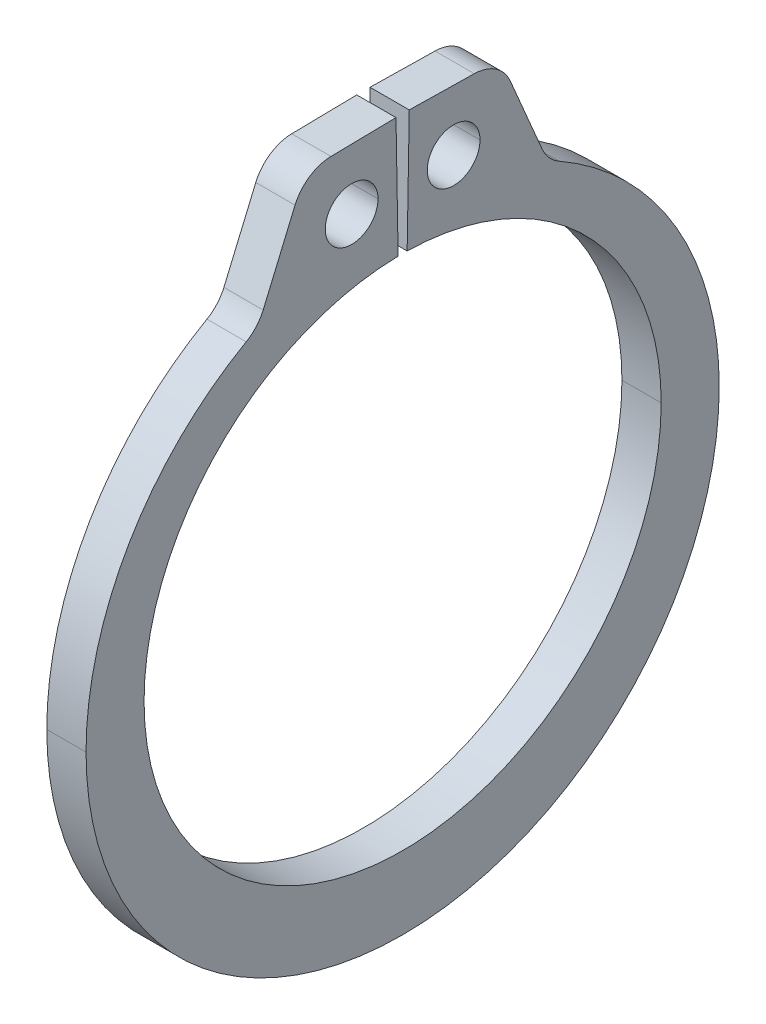
ISO-10303-21;
HEADER;
FILE_DESCRIPTION(('STEP AP214'),'2;1');
FILE_NAME('part.step','',(''),(''),'','','');
FILE_SCHEMA(('AUTOMOTIVE_DESIGN { 1 0 10303 214 1 1 1 1 }'));
ENDSEC;
DATA;
#1=APPLICATION_CONTEXT('core data for automotive mechanical design processes');
#2=APPLICATION_PROTOCOL_DEFINITION('international standard','automotive_design',2000,#1);
#3=PRODUCT_CONTEXT('',#1,'mechanical');
#4=PRODUCT('Part','Part','',(#3));
#5=PRODUCT_RELATED_PRODUCT_CATEGORY('part','',(#4));
#6=PRODUCT_DEFINITION_FORMATION('','',#4);
#7=PRODUCT_DEFINITION_CONTEXT('part definition',#1,'design');
#8=PRODUCT_DEFINITION('design','',#6,#7);
#9=PRODUCT_DEFINITION_SHAPE('','',#8);
#10=(LENGTH_UNIT() NAMED_UNIT(*) SI_UNIT(.MILLI.,.METRE.));
#11=(NAMED_UNIT(*) PLANE_ANGLE_UNIT() SI_UNIT($,.RADIAN.));
#12=(NAMED_UNIT(*) SI_UNIT($,.STERADIAN.) SOLID_ANGLE_UNIT());
#13=UNCERTAINTY_MEASURE_WITH_UNIT(LENGTH_MEASURE(1.E-05),#10,'distance_accuracy_value','');
#14=(GEOMETRIC_REPRESENTATION_CONTEXT(3) GLOBAL_UNCERTAINTY_ASSIGNED_CONTEXT((#13)) GLOBAL_UNIT_ASSIGNED_CONTEXT((#10,
#11,#12)) REPRESENTATION_CONTEXT('',''));
#15=CARTESIAN_POINT('',(0.,0.,0.));
#16=DIRECTION('',(0.,0.,1.));
#17=DIRECTION('',(1.,0.,0.));
#18=AXIS2_PLACEMENT_3D('',#15,#16,#17);
#19=CARTESIAN_POINT('',(0.4445,7.66933071962558,-1.60650376158788));
#20=DIRECTION('',(-1.,0.,0.));
#21=DIRECTION('',(0.,0.,1.));
#22=AXIS2_PLACEMENT_3D('',#19,#20,#21);
#23=CYLINDRICAL_SURFACE('',#22,0.9017);
#24=CARTESIAN_POINT('',(0.4445,7.66933071962558,-1.60650376158788));
#25=DIRECTION('',(1.,0.,0.));
#26=DIRECTION('',(0.,0.,-1.));
#27=AXIS2_PLACEMENT_3D('',#24,#25,#26);
#28=CIRCLE('',#27,0.9017);
#29=CARTESIAN_POINT('',(0.4445,8.02240621636442,-2.43620285379096));
#30=VERTEX_POINT('',#29);
#31=CARTESIAN_POINT('',(0.4445,8.5708933863481,-1.62224059647238));
#32=VERTEX_POINT('',#31);
#33=EDGE_CURVE('E254',#30,#32,#28,.T.);
#34=ORIENTED_EDGE('',*,*,#33,.F.);
#35=DIRECTION('',(1.,0.,0.));
#36=VECTOR('',#35,1.);
#37=CARTESIAN_POINT('',(0.4445,8.02240621636442,-2.43620285379096));
#38=LINE('',#37,#36);
#39=CARTESIAN_POINT('',(-0.4445,8.02240621636442,-2.43620285379096));
#40=VERTEX_POINT('',#39);
#41=EDGE_CURVE('E392',#40,#30,#38,.T.);
#42=ORIENTED_EDGE('',*,*,#41,.F.);
#43=CARTESIAN_POINT('',(-0.4445,7.66933071962558,-1.60650376158788));
#44=DIRECTION('',(-1.,0.,0.));
#45=DIRECTION('',(0.,0.,-1.));
#46=AXIS2_PLACEMENT_3D('',#43,#44,#45);
#47=CIRCLE('',#46,0.9017);
#48=CARTESIAN_POINT('',(-0.4445,8.5708933863481,-1.62224059647238));
#49=VERTEX_POINT('',#48);
#50=EDGE_CURVE('E297',#49,#40,#47,.T.);
#51=ORIENTED_EDGE('',*,*,#50,.F.);
#52=DIRECTION('',(-1.,0.,0.));
#53=VECTOR('',#52,1.);
#54=CARTESIAN_POINT('',(0.4445,8.5708933863481,-1.62224059647238));
#55=LINE('',#54,#53);
#56=EDGE_CURVE('E27',#32,#49,#55,.T.);
#57=ORIENTED_EDGE('',*,*,#56,.F.);
#58=EDGE_LOOP('',(#34,#42,#51,#57));
#59=FACE_BOUND('',#58,.T.);
#60=ADVANCED_FACE('F16',(#59),#23,.T.);
#61=CARTESIAN_POINT('',(0.4445,7.66933071962558,1.60650376158788));
#62=DIRECTION('',(-1.,0.,0.));
#63=DIRECTION('',(0.,0.,1.));
#64=AXIS2_PLACEMENT_3D('',#61,#62,#63);
#65=CYLINDRICAL_SURFACE('',#64,0.9017);
#66=CARTESIAN_POINT('',(0.4445,7.66933071962558,1.60650376158788));
#67=DIRECTION('',(1.,0.,0.));
#68=DIRECTION('',(0.,0.,-1.));
#69=AXIS2_PLACEMENT_3D('',#66,#67,#68);
#70=CIRCLE('',#69,0.9017);
#71=CARTESIAN_POINT('',(0.4445,8.5708933863481,1.62224059647238));
#72=VERTEX_POINT('',#71);
#73=CARTESIAN_POINT('',(0.4445,8.02240621636442,2.43620285379096));
#74=VERTEX_POINT('',#73);
#75=EDGE_CURVE('E217',#72,#74,#70,.T.);
#76=ORIENTED_EDGE('',*,*,#75,.F.);
#77=DIRECTION('',(1.,0.,0.));
#78=VECTOR('',#77,1.);
#79=CARTESIAN_POINT('',(0.4445,8.5708933863481,1.62224059647238));
#80=LINE('',#79,#78);
#81=CARTESIAN_POINT('',(-0.4445,8.5708933863481,1.62224059647238));
#82=VERTEX_POINT('',#81);
#83=EDGE_CURVE('E325',#82,#72,#80,.T.);
#84=ORIENTED_EDGE('',*,*,#83,.F.);
#85=CARTESIAN_POINT('',(-0.4445,7.66933071962558,1.60650376158788));
#86=DIRECTION('',(-1.,0.,0.));
#87=DIRECTION('',(0.,0.,-1.));
#88=AXIS2_PLACEMENT_3D('',#85,#86,#87);
#89=CIRCLE('',#88,0.9017);
#90=CARTESIAN_POINT('',(-0.4445,8.02240621636442,2.43620285379096));
#91=VERTEX_POINT('',#90);
#92=EDGE_CURVE('E283',#91,#82,#89,.T.);
#93=ORIENTED_EDGE('',*,*,#92,.F.);
#94=DIRECTION('',(-1.,0.,0.));
#95=VECTOR('',#94,1.);
#96=CARTESIAN_POINT('',(0.4445,8.02240621636442,2.43620285379096));
#97=LINE('',#96,#95);
#98=EDGE_CURVE('E192',#74,#91,#97,.T.);
#99=ORIENTED_EDGE('',*,*,#98,.F.);
#100=EDGE_LOOP('',(#76,#84,#93,#99));
#101=FACE_BOUND('',#100,.T.);
#102=ADVANCED_FACE('F418',(#101),#65,.T.);
#103=CARTESIAN_POINT('',(0.4445,6.67924006299657,-3.98773154521691));
#104=DIRECTION('',(-1.,0.,0.));
#105=DIRECTION('',(0.,0.,1.));
#106=AXIS2_PLACEMENT_3D('',#103,#104,#105);
#107=CYLINDRICAL_SURFACE('',#106,0.9017);
#108=CARTESIAN_POINT('',(0.4445,6.67924006299657,-3.98773154521691));
#109=DIRECTION('',(-1.,0.,0.));
#110=DIRECTION('',(0.,0.,-1.));
#111=AXIS2_PLACEMENT_3D('',#108,#109,#110);
#112=CIRCLE('',#111,0.9017);
#113=CARTESIAN_POINT('',(0.4445,5.89530863003733,-3.54218199868087));
#114=VERTEX_POINT('',#113);
#115=CARTESIAN_POINT('',(0.4445,6.32616456625773,-3.15803245301383));
#116=VERTEX_POINT('',#115);
#117=EDGE_CURVE('E204',#114,#116,#112,.T.);
#118=ORIENTED_EDGE('',*,*,#117,.F.);
#119=DIRECTION('',(1.,0.,0.));
#120=VECTOR('',#119,1.);
#121=CARTESIAN_POINT('',(0.4445,5.89530863003733,-3.54218199868087));
#122=LINE('',#121,#120);
#123=CARTESIAN_POINT('',(-0.4445,5.89530863003733,-3.54218199868087));
#124=VERTEX_POINT('',#123);
#125=EDGE_CURVE('E229',#124,#114,#122,.T.);
#126=ORIENTED_EDGE('',*,*,#125,.F.);
#127=CARTESIAN_POINT('',(-0.4445,6.67924006299657,-3.98773154521691));
#128=DIRECTION('',(1.,0.,0.));
#129=DIRECTION('',(0.,0.,-1.));
#130=AXIS2_PLACEMENT_3D('',#127,#128,#129);
#131=CIRCLE('',#130,0.9017);
#132=CARTESIAN_POINT('',(-0.4445,6.32616456625773,-3.15803245301383));
#133=VERTEX_POINT('',#132);
#134=EDGE_CURVE('E287',#133,#124,#131,.T.);
#135=ORIENTED_EDGE('',*,*,#134,.F.);
#136=DIRECTION('',(-1.,0.,0.));
#137=VECTOR('',#136,1.);
#138=CARTESIAN_POINT('',(-0.4445,6.32616456625773,-3.15803245301383));
#139=LINE('',#138,#137);
#140=EDGE_CURVE('E191',#116,#133,#139,.T.);
#141=ORIENTED_EDGE('',*,*,#140,.F.);
#142=EDGE_LOOP('',(#118,#126,#135,#141));
#143=FACE_BOUND('',#142,.T.);
#144=ADVANCED_FACE('F413',(#143),#107,.F.);
#145=CARTESIAN_POINT('',(0.4445,6.67924006299657,3.98773154521691));
#146=DIRECTION('',(-1.,0.,0.));
#147=DIRECTION('',(0.,0.,1.));
#148=AXIS2_PLACEMENT_3D('',#145,#146,#147);
#149=CYLINDRICAL_SURFACE('',#148,0.9017);
#150=CARTESIAN_POINT('',(0.4445,6.67924006299657,3.98773154521691));
#151=DIRECTION('',(-1.,0.,0.));
#152=DIRECTION('',(0.,0.,-1.));
#153=AXIS2_PLACEMENT_3D('',#150,#151,#152);
#154=CIRCLE('',#153,0.9017);
#155=CARTESIAN_POINT('',(0.4445,6.32616456625773,3.15803245301383));
#156=VERTEX_POINT('',#155);
#157=CARTESIAN_POINT('',(0.4445,5.89530863003733,3.54218199868087));
#158=VERTEX_POINT('',#157);
#159=EDGE_CURVE('E185',#156,#158,#154,.T.);
#160=ORIENTED_EDGE('',*,*,#159,.F.);
#161=DIRECTION('',(1.,0.,0.));
#162=VECTOR('',#161,1.);
#163=CARTESIAN_POINT('',(0.4445,6.32616456625773,3.15803245301383));
#164=LINE('',#163,#162);
#165=CARTESIAN_POINT('',(-0.4445,6.32616456625773,3.15803245301383));
#166=VERTEX_POINT('',#165);
#167=EDGE_CURVE('E303',#166,#156,#164,.T.);
#168=ORIENTED_EDGE('',*,*,#167,.F.);
#169=CARTESIAN_POINT('',(-0.4445,6.67924006299657,3.98773154521691));
#170=DIRECTION('',(1.,0.,0.));
#171=DIRECTION('',(0.,0.,-1.));
#172=AXIS2_PLACEMENT_3D('',#169,#170,#171);
#173=CIRCLE('',#172,0.9017);
#174=CARTESIAN_POINT('',(-0.4445,5.89530863003733,3.54218199868087));
#175=VERTEX_POINT('',#174);
#176=EDGE_CURVE('E188',#175,#166,#173,.T.);
#177=ORIENTED_EDGE('',*,*,#176,.F.);
#178=DIRECTION('',(-1.,0.,0.));
#179=VECTOR('',#178,1.);
#180=CARTESIAN_POINT('',(0.4445,5.89530863003733,3.54218199868087));
#181=LINE('',#180,#179);
#182=EDGE_CURVE('E42',#158,#175,#181,.T.);
#183=ORIENTED_EDGE('',*,*,#182,.F.);
#184=EDGE_LOOP('',(#160,#168,#177,#183));
#185=FACE_BOUND('',#184,.T.);
#186=ADVANCED_FACE('F182',(#185),#149,.F.);
#187=CARTESIAN_POINT('',(0.4445,7.20724610900658,-1.15465964864512));
#188=DIRECTION('',(-1.,0.,0.));
#189=DIRECTION('',(0.,0.,1.));
#190=AXIS2_PLACEMENT_3D('',#187,#188,#189);
#191=CYLINDRICAL_SURFACE('',#190,0.5969);
#192=DIRECTION('',(-1.,0.,0.));
#193=VECTOR('',#192,1.);
#194=CARTESIAN_POINT('',(0.4445,7.20724610900658,-1.75155964864513));
#195=LINE('',#194,#193);
#196=CARTESIAN_POINT('',(0.4445,7.20724610900658,-1.75155964864513));
#197=VERTEX_POINT('',#196);
#198=CARTESIAN_POINT('',(-0.4445,7.20724610900658,-1.75155964864513));
#199=VERTEX_POINT('',#198);
#200=EDGE_CURVE('E317',#197,#199,#195,.T.);
#201=ORIENTED_EDGE('',*,*,#200,.F.);
#202=CARTESIAN_POINT('',(0.4445,7.20724610900658,-1.15465964864512));
#203=DIRECTION('',(1.,0.,0.));
#204=DIRECTION('',(0.,0.,-1.));
#205=AXIS2_PLACEMENT_3D('',#202,#203,#204);
#206=CIRCLE('',#205,0.5969);
#207=CARTESIAN_POINT('',(0.4445,7.20724610900658,-0.557759648645124));
#208=VERTEX_POINT('',#207);
#209=EDGE_CURVE('E72',#197,#208,#206,.T.);
#210=ORIENTED_EDGE('',*,*,#209,.T.);
#211=DIRECTION('',(-1.,0.,0.));
#212=VECTOR('',#211,1.);
#213=CARTESIAN_POINT('',(0.4445,7.20724610900658,-0.557759648645124));
#214=LINE('',#213,#212);
#215=CARTESIAN_POINT('',(-0.4445,7.20724610900658,-0.557759648645124));
#216=VERTEX_POINT('',#215);
#217=EDGE_CURVE('E316',#208,#216,#214,.T.);
#218=ORIENTED_EDGE('',*,*,#217,.T.);
#219=CARTESIAN_POINT('',(-0.4445,7.20724610900658,-1.15465964864512));
#220=DIRECTION('',(1.,0.,0.));
#221=DIRECTION('',(0.,0.,-1.));
#222=AXIS2_PLACEMENT_3D('',#219,#220,#221);
#223=CIRCLE('',#222,0.5969);
#224=EDGE_CURVE('E89',#199,#216,#223,.T.);
#225=ORIENTED_EDGE('',*,*,#224,.F.);
#226=EDGE_LOOP('',(#201,#210,#218,#225));
#227=FACE_BOUND('',#226,.T.);
#228=ADVANCED_FACE('F401',(#227),#191,.F.);
#229=CARTESIAN_POINT('',(0.4445,7.20724610900658,1.15465964864512));
#230=DIRECTION('',(-1.,0.,0.));
#231=DIRECTION('',(0.,0.,1.));
#232=AXIS2_PLACEMENT_3D('',#229,#230,#231);
#233=CYLINDRICAL_SURFACE('',#232,0.5969);
#234=DIRECTION('',(-1.,0.,0.));
#235=VECTOR('',#234,1.);
#236=CARTESIAN_POINT('',(0.4445,7.20724610900658,0.557759648645124));
#237=LINE('',#236,#235);
#238=CARTESIAN_POINT('',(0.4445,7.20724610900658,0.557759648645124));
#239=VERTEX_POINT('',#238);
#240=CARTESIAN_POINT('',(-0.4445,7.20724610900658,0.557759648645124));
#241=VERTEX_POINT('',#240);
#242=EDGE_CURVE('E321',#239,#241,#237,.T.);
#243=ORIENTED_EDGE('',*,*,#242,.F.);
#244=CARTESIAN_POINT('',(0.4445,7.20724610900658,1.15465964864512));
#245=DIRECTION('',(1.,0.,0.));
#246=DIRECTION('',(0.,0.,-1.));
#247=AXIS2_PLACEMENT_3D('',#244,#245,#246);
#248=CIRCLE('',#247,0.5969);
#249=CARTESIAN_POINT('',(0.4445,7.20724610900658,1.75155964864513));
#250=VERTEX_POINT('',#249);
#251=EDGE_CURVE('E272',#239,#250,#248,.T.);
#252=ORIENTED_EDGE('',*,*,#251,.T.);
#253=DIRECTION('',(-1.,0.,0.));
#254=VECTOR('',#253,1.);
#255=CARTESIAN_POINT('',(0.4445,7.20724610900658,1.75155964864513));
#256=LINE('',#255,#254);
#257=CARTESIAN_POINT('',(-0.4445,7.20724610900658,1.75155964864513));
#258=VERTEX_POINT('',#257);
#259=EDGE_CURVE('E249',#250,#258,#256,.T.);
#260=ORIENTED_EDGE('',*,*,#259,.T.);
#261=CARTESIAN_POINT('',(-0.4445,7.20724610900658,1.15465964864512));
#262=DIRECTION('',(1.,0.,0.));
#263=DIRECTION('',(0.,0.,-1.));
#264=AXIS2_PLACEMENT_3D('',#261,#262,#263);
#265=CIRCLE('',#264,0.5969);
#266=EDGE_CURVE('E284',#241,#258,#265,.T.);
#267=ORIENTED_EDGE('',*,*,#266,.F.);
#268=EDGE_LOOP('',(#243,#252,#260,#267));
#269=FACE_BOUND('',#268,.T.);
#270=ADVANCED_FACE('F403',(#269),#233,.F.);
#271=CARTESIAN_POINT('',(0.4445,5.85380830083213,-0.102178603968365));
#272=DIRECTION('',(0.,-0.0174524064372833,-0.999847695156391));
#273=DIRECTION('',(0.,-0.999847695156391,0.0174524064372833));
#274=AXIS2_PLACEMENT_3D('',#271,#272,#273);
#275=PLANE('',#274);
#276=DIRECTION('',(0.,-0.999847695156391,0.0174524064372833));
#277=VECTOR('',#276,1.);
#278=CARTESIAN_POINT('',(-0.4445,5.85380830083213,-0.102178603968365));
#279=LINE('',#278,#277);
#280=CARTESIAN_POINT('',(-0.4445,8.59659049818515,-0.15005404530712));
#281=VERTEX_POINT('',#280);
#282=CARTESIAN_POINT('',(-0.4445,5.85380830083213,-0.102178603968365));
#283=VERTEX_POINT('',#282);
#284=EDGE_CURVE('E353',#281,#283,#279,.T.);
#285=ORIENTED_EDGE('',*,*,#284,.T.);
#286=DIRECTION('',(-1.,0.,0.));
#287=VECTOR('',#286,1.);
#288=CARTESIAN_POINT('',(0.4445,5.85380830083213,-0.102178603968365));
#289=LINE('',#288,#287);
#290=CARTESIAN_POINT('',(0.4445,5.85380830083213,-0.102178603968365));
#291=VERTEX_POINT('',#290);
#292=EDGE_CURVE('E326',#291,#283,#289,.T.);
#293=ORIENTED_EDGE('',*,*,#292,.F.);
#294=DIRECTION('',(0.,-0.999847695156391,0.0174524064372833));
#295=VECTOR('',#294,1.);
#296=CARTESIAN_POINT('',(0.4445,5.85380830083213,-0.102178603968365));
#297=LINE('',#296,#295);
#298=CARTESIAN_POINT('',(0.4445,8.59659049818515,-0.15005404530712));
#299=VERTEX_POINT('',#298);
#300=EDGE_CURVE('E274',#299,#291,#297,.T.);
#301=ORIENTED_EDGE('',*,*,#300,.F.);
#302=DIRECTION('',(-1.,0.,0.));
#303=VECTOR('',#302,1.);
#304=CARTESIAN_POINT('',(0.4445,8.59659049818515,-0.15005404530712));
#305=LINE('',#304,#303);
#306=EDGE_CURVE('E11',#299,#281,#305,.T.);
#307=ORIENTED_EDGE('',*,*,#306,.T.);
#308=EDGE_LOOP('',(#285,#293,#301,#307));
#309=FACE_BOUND('',#308,.T.);
#310=ADVANCED_FACE('F410',(#309),#275,.F.);
#311=CARTESIAN_POINT('',(0.4445,8.59659049818515,-0.15005404530712));
#312=DIRECTION('',(0.,-0.999847695156391,0.01745240643729));
#313=DIRECTION('',(-1.,0.,0.));
#314=AXIS2_PLACEMENT_3D('',#311,#312,#313);
#315=PLANE('',#314);
#316=DIRECTION('',(0.,0.01745240643729,0.999847695156391));
#317=VECTOR('',#316,1.);
#318=CARTESIAN_POINT('',(0.4445,8.59659049818515,-0.15005404530712));
#319=LINE('',#318,#317);
#320=EDGE_CURVE('E258',#32,#299,#319,.T.);
#321=ORIENTED_EDGE('',*,*,#320,.F.);
#322=ORIENTED_EDGE('',*,*,#56,.T.);
#323=DIRECTION('',(0.,0.01745240643729,0.999847695156391));
#324=VECTOR('',#323,1.);
#325=CARTESIAN_POINT('',(-0.4445,8.59659049818515,-0.15005404530712));
#326=LINE('',#325,#324);
#327=EDGE_CURVE('E301',#49,#281,#326,.T.);
#328=ORIENTED_EDGE('',*,*,#327,.T.);
#329=ORIENTED_EDGE('',*,*,#306,.F.);
#330=EDGE_LOOP('',(#321,#322,#328,#329));
#331=FACE_BOUND('',#330,.T.);
#332=ADVANCED_FACE('F440',(#331),#315,.F.);
#333=CARTESIAN_POINT('',(0.4445,8.56068391718107,-2.20714069332188));
#334=DIRECTION('',(0.,-0.391566481910657,0.920149819455567));
#335=DIRECTION('',(-1.,0.,0.));
#336=AXIS2_PLACEMENT_3D('',#333,#334,#335);
#337=PLANE('',#336);
#338=DIRECTION('',(0.,0.920149819455566,0.391566481910657));
#339=VECTOR('',#338,1.);
#340=CARTESIAN_POINT('',(0.4445,8.56068391718107,-2.20714069332188));
#341=LINE('',#340,#339);
#342=EDGE_CURVE('E225',#116,#30,#341,.T.);
#343=ORIENTED_EDGE('',*,*,#342,.F.);
#344=ORIENTED_EDGE('',*,*,#140,.T.);
#345=DIRECTION('',(0.,0.920149819455566,0.391566481910657));
#346=VECTOR('',#345,1.);
#347=CARTESIAN_POINT('',(-0.4445,8.56068391718107,-2.20714069332188));
#348=LINE('',#347,#346);
#349=EDGE_CURVE('E292',#133,#40,#348,.T.);
#350=ORIENTED_EDGE('',*,*,#349,.T.);
#351=ORIENTED_EDGE('',*,*,#41,.T.);
#352=EDGE_LOOP('',(#343,#344,#350,#351));
#353=FACE_BOUND('',#352,.T.);
#354=ADVANCED_FACE('F438',(#353),#337,.F.);
#355=CARTESIAN_POINT('',(0.4445,-0.337057291142252,0.));
#356=DIRECTION('',(-1.,0.,0.));
#357=DIRECTION('',(0.,0.,1.));
#358=AXIS2_PLACEMENT_3D('',#355,#356,#357);
#359=CYLINDRICAL_SURFACE('',#358,7.16864270885776);
#360=DIRECTION('',(-1.,0.,0.));
#361=VECTOR('',#360,1.);
#362=CARTESIAN_POINT('',(0.4445,-0.337057291142252,7.16864270885776));
#363=LINE('',#362,#361);
#364=CARTESIAN_POINT('',(0.4445,-0.337057291142252,7.16864270885776));
#365=VERTEX_POINT('',#364);
#366=CARTESIAN_POINT('',(-0.4445,-0.337057291142252,7.16864270885776));
#367=VERTEX_POINT('',#366);
#368=EDGE_CURVE('E199',#365,#367,#363,.T.);
#369=ORIENTED_EDGE('',*,*,#368,.F.);
#370=CARTESIAN_POINT('',(0.4445,-0.337057291142252,0.));
#371=DIRECTION('',(1.,0.,0.));
#372=DIRECTION('',(0.,0.,-1.));
#373=AXIS2_PLACEMENT_3D('',#370,#371,#372);
#374=CIRCLE('',#373,7.16864270885776);
#375=EDGE_CURVE('E196',#158,#365,#374,.T.);
#376=ORIENTED_EDGE('',*,*,#375,.F.);
#377=ORIENTED_EDGE('',*,*,#182,.T.);
#378=CARTESIAN_POINT('',(-0.4445,-0.337057291142252,0.));
#379=DIRECTION('',(1.,0.,0.));
#380=DIRECTION('',(0.,0.,-1.));
#381=AXIS2_PLACEMENT_3D('',#378,#379,#380);
#382=CIRCLE('',#381,7.16864270885776);
#383=EDGE_CURVE('E291',#175,#367,#382,.T.);
#384=ORIENTED_EDGE('',*,*,#383,.T.);
#385=EDGE_LOOP('',(#369,#376,#377,#384));
#386=FACE_BOUND('',#385,.T.);
#387=ADVANCED_FACE('F197',(#386),#359,.T.);
#388=CARTESIAN_POINT('',(0.4445,8.56068391718107,2.20714069332188));
#389=DIRECTION('',(0.,-0.391566481910657,-0.920149819455567));
#390=DIRECTION('',(0.,-0.920149819455567,0.391566481910657));
#391=AXIS2_PLACEMENT_3D('',#388,#389,#390);
#392=PLANE('',#391);
#393=DIRECTION('',(0.,-0.920149819455566,0.391566481910657));
#394=VECTOR('',#393,1.);
#395=CARTESIAN_POINT('',(-0.4445,8.56068391718107,2.20714069332188));
#396=LINE('',#395,#394);
#397=EDGE_CURVE('E307',#91,#166,#396,.T.);
#398=ORIENTED_EDGE('',*,*,#397,.T.);
#399=ORIENTED_EDGE('',*,*,#167,.T.);
#400=DIRECTION('',(0.,-0.920149819455566,0.391566481910657));
#401=VECTOR('',#400,1.);
#402=CARTESIAN_POINT('',(0.4445,8.56068391718107,2.20714069332188));
#403=LINE('',#402,#401);
#404=EDGE_CURVE('E210',#74,#156,#403,.T.);
#405=ORIENTED_EDGE('',*,*,#404,.F.);
#406=ORIENTED_EDGE('',*,*,#98,.T.);
#407=EDGE_LOOP('',(#398,#399,#405,#406));
#408=FACE_BOUND('',#407,.T.);
#409=ADVANCED_FACE('F447',(#408),#392,.F.);
#410=CARTESIAN_POINT('',(0.4445,8.59659049818515,0.15005404530712));
#411=DIRECTION('',(0.,-0.999847695156391,-0.01745240643729));
#412=DIRECTION('',(0.,0.01745240643729,-0.999847695156391));
#413=AXIS2_PLACEMENT_3D('',#410,#411,#412);
#414=PLANE('',#413);
#415=DIRECTION('',(0.,-0.01745240643729,0.999847695156391));
#416=VECTOR('',#415,1.);
#417=CARTESIAN_POINT('',(-0.4445,8.59659049818515,0.15005404530712));
#418=LINE('',#417,#416);
#419=CARTESIAN_POINT('',(-0.4445,8.59659049818515,0.15005404530712));
#420=VERTEX_POINT('',#419);
#421=EDGE_CURVE('E278',#420,#82,#418,.T.);
#422=ORIENTED_EDGE('',*,*,#421,.T.);
#423=ORIENTED_EDGE('',*,*,#83,.T.);
#424=DIRECTION('',(0.,-0.01745240643729,0.999847695156391));
#425=VECTOR('',#424,1.);
#426=CARTESIAN_POINT('',(0.4445,8.59659049818515,0.15005404530712));
#427=LINE('',#426,#425);
#428=CARTESIAN_POINT('',(0.4445,8.59659049818515,0.15005404530712));
#429=VERTEX_POINT('',#428);
#430=EDGE_CURVE('E329',#429,#72,#427,.T.);
#431=ORIENTED_EDGE('',*,*,#430,.F.);
#432=DIRECTION('',(-1.,0.,0.));
#433=VECTOR('',#432,1.);
#434=CARTESIAN_POINT('',(0.4445,8.59659049818515,0.15005404530712));
#435=LINE('',#434,#433);
#436=EDGE_CURVE('E322',#429,#420,#435,.T.);
#437=ORIENTED_EDGE('',*,*,#436,.T.);
#438=EDGE_LOOP('',(#422,#423,#431,#437));
#439=FACE_BOUND('',#438,.T.);
#440=ADVANCED_FACE('F443',(#439),#414,.F.);
#441=CARTESIAN_POINT('',(0.4445,5.85380830083213,0.102178603968365));
#442=DIRECTION('',(0.,-0.0174524064372833,0.999847695156391));
#443=DIRECTION('',(-1.,0.,0.));
#444=AXIS2_PLACEMENT_3D('',#441,#442,#443);
#445=PLANE('',#444);
#446=DIRECTION('',(0.,0.999847695156391,0.0174524064372833));
#447=VECTOR('',#446,1.);
#448=CARTESIAN_POINT('',(-0.4445,5.85380830083213,0.102178603968365));
#449=LINE('',#448,#447);
#450=CARTESIAN_POINT('',(-0.4445,5.85380830083213,0.102178603968365));
#451=VERTEX_POINT('',#450);
#452=EDGE_CURVE('E282',#451,#420,#449,.T.);
#453=ORIENTED_EDGE('',*,*,#452,.T.);
#454=ORIENTED_EDGE('',*,*,#436,.F.);
#455=DIRECTION('',(0.,0.999847695156391,0.0174524064372833));
#456=VECTOR('',#455,1.);
#457=CARTESIAN_POINT('',(0.4445,5.85380830083213,0.102178603968365));
#458=LINE('',#457,#456);
#459=CARTESIAN_POINT('',(0.4445,5.85380830083213,0.102178603968365));
#460=VERTEX_POINT('',#459);
#461=EDGE_CURVE('E268',#460,#429,#458,.T.);
#462=ORIENTED_EDGE('',*,*,#461,.F.);
#463=DIRECTION('',(-1.,0.,0.));
#464=VECTOR('',#463,1.);
#465=CARTESIAN_POINT('',(0.4445,5.85380830083213,0.102178603968365));
#466=LINE('',#465,#464);
#467=EDGE_CURVE('E342',#460,#451,#466,.T.);
#468=ORIENTED_EDGE('',*,*,#467,.T.);
#469=EDGE_LOOP('',(#453,#454,#462,#468));
#470=FACE_BOUND('',#469,.T.);
#471=ADVANCED_FACE('F446',(#470),#445,.F.);
#472=CARTESIAN_POINT('',(0.4445,0.,0.));
#473=DIRECTION('',(-1.,0.,0.));
#474=DIRECTION('',(0.,0.,1.));
#475=AXIS2_PLACEMENT_3D('',#472,#473,#474);
#476=CYLINDRICAL_SURFACE('',#475,5.8547);
#477=DIRECTION('',(-1.,0.,0.));
#478=VECTOR('',#477,1.);
#479=CARTESIAN_POINT('',(0.4445,0.,-5.8547));
#480=LINE('',#479,#478);
#481=CARTESIAN_POINT('',(0.4445,0.,-5.8547));
#482=VERTEX_POINT('',#481);
#483=CARTESIAN_POINT('',(-0.4445,0.,-5.8547));
#484=VERTEX_POINT('',#483);
#485=EDGE_CURVE('E338',#482,#484,#480,.T.);
#486=ORIENTED_EDGE('',*,*,#485,.F.);
#487=CARTESIAN_POINT('',(0.4445,0.,0.));
#488=DIRECTION('',(-1.,0.,0.));
#489=DIRECTION('',(0.,0.,-1.));
#490=AXIS2_PLACEMENT_3D('',#487,#488,#489);
#491=CIRCLE('',#490,5.8547);
#492=EDGE_CURVE('E273',#291,#482,#491,.T.);
#493=ORIENTED_EDGE('',*,*,#492,.F.);
#494=ORIENTED_EDGE('',*,*,#292,.T.);
#495=CARTESIAN_POINT('',(-0.4445,0.,0.));
#496=DIRECTION('',(-1.,0.,0.));
#497=DIRECTION('',(0.,0.,-1.));
#498=AXIS2_PLACEMENT_3D('',#495,#496,#497);
#499=CIRCLE('',#498,5.8547);
#500=EDGE_CURVE('E349',#283,#484,#499,.T.);
#501=ORIENTED_EDGE('',*,*,#500,.T.);
#502=EDGE_LOOP('',(#486,#493,#494,#501));
#503=FACE_BOUND('',#502,.T.);
#504=ADVANCED_FACE('F18',(#503),#476,.F.);
#505=CARTESIAN_POINT('',(-0.4445,0.,0.));
#506=DIRECTION('',(1.,0.,0.));
#507=DIRECTION('',(0.,1.,0.));
#508=AXIS2_PLACEMENT_3D('',#505,#506,#507);
#509=PLANE('',#508);
#510=CARTESIAN_POINT('',(-0.4445,7.20724610900658,-1.15465964864512));
#511=DIRECTION('',(1.,0.,0.));
#512=DIRECTION('',(0.,0.,-1.));
#513=AXIS2_PLACEMENT_3D('',#510,#511,#512);
#514=CIRCLE('',#513,0.5969);
#515=EDGE_CURVE('E313',#216,#199,#514,.T.);
#516=ORIENTED_EDGE('',*,*,#515,.T.);
#517=ORIENTED_EDGE('',*,*,#224,.T.);
#518=EDGE_LOOP('',(#516,#517));
#519=FACE_BOUND('',#518,.T.);
#520=CARTESIAN_POINT('',(-0.4445,7.20724610900658,1.15465964864512));
#521=DIRECTION('',(1.,0.,0.));
#522=DIRECTION('',(0.,0.,-1.));
#523=AXIS2_PLACEMENT_3D('',#520,#521,#522);
#524=CIRCLE('',#523,0.5969);
#525=EDGE_CURVE('E296',#258,#241,#524,.T.);
#526=ORIENTED_EDGE('',*,*,#525,.T.);
#527=ORIENTED_EDGE('',*,*,#266,.T.);
#528=EDGE_LOOP('',(#526,#527));
#529=FACE_BOUND('',#528,.T.);
#530=ORIENTED_EDGE('',*,*,#397,.F.);
#531=ORIENTED_EDGE('',*,*,#92,.T.);
#532=ORIENTED_EDGE('',*,*,#421,.F.);
#533=ORIENTED_EDGE('',*,*,#452,.F.);
#534=CARTESIAN_POINT('',(-0.4445,0.,0.));
#535=DIRECTION('',(-1.,0.,0.));
#536=DIRECTION('',(0.,0.,-1.));
#537=AXIS2_PLACEMENT_3D('',#534,#535,#536);
#538=CIRCLE('',#537,5.8547);
#539=CARTESIAN_POINT('',(-0.4445,0.,5.8547));
#540=VERTEX_POINT('',#539);
#541=EDGE_CURVE('E20',#540,#451,#538,.T.);
#542=ORIENTED_EDGE('',*,*,#541,.F.);
#543=CARTESIAN_POINT('',(-0.4445,0.,0.));
#544=DIRECTION('',(-1.,0.,0.));
#545=DIRECTION('',(0.,0.,-1.));
#546=AXIS2_PLACEMENT_3D('',#543,#544,#545);
#547=CIRCLE('',#546,5.8547);
#548=EDGE_CURVE('E267',#484,#540,#547,.T.);
#549=ORIENTED_EDGE('',*,*,#548,.F.);
#550=ORIENTED_EDGE('',*,*,#500,.F.);
#551=ORIENTED_EDGE('',*,*,#284,.F.);
#552=ORIENTED_EDGE('',*,*,#327,.F.);
#553=ORIENTED_EDGE('',*,*,#50,.T.);
#554=ORIENTED_EDGE('',*,*,#349,.F.);
#555=ORIENTED_EDGE('',*,*,#134,.T.);
#556=CARTESIAN_POINT('',(-0.4445,-0.337057291142252,0.));
#557=DIRECTION('',(1.,0.,0.));
#558=DIRECTION('',(0.,0.,-1.));
#559=AXIS2_PLACEMENT_3D('',#556,#557,#558);
#560=CIRCLE('',#559,7.16864270885776);
#561=CARTESIAN_POINT('',(-0.4445,-0.337057291142251,-7.16864270885776));
#562=VERTEX_POINT('',#561);
#563=EDGE_CURVE('E226',#562,#124,#560,.T.);
#564=ORIENTED_EDGE('',*,*,#563,.F.);
#565=CARTESIAN_POINT('',(-0.4445,-0.337057291142252,0.));
#566=DIRECTION('',(1.,0.,0.));
#567=DIRECTION('',(0.,0.,-1.));
#568=AXIS2_PLACEMENT_3D('',#565,#566,#567);
#569=CIRCLE('',#568,7.16864270885776);
#570=EDGE_CURVE('E261',#367,#562,#569,.T.);
#571=ORIENTED_EDGE('',*,*,#570,.F.);
#572=ORIENTED_EDGE('',*,*,#383,.F.);
#573=ORIENTED_EDGE('',*,*,#176,.T.);
#574=EDGE_LOOP('',(#530,#531,#532,#533,#542,#549,#550,#551,#552,#553,#554,#555,#564,#571,#572,#573));
#575=FACE_BOUND('',#574,.T.);
#576=ADVANCED_FACE('F458',(#519,#529,#575),#509,.F.);
#577=CARTESIAN_POINT('',(0.4445,0.,0.));
#578=DIRECTION('',(1.,0.,0.));
#579=DIRECTION('',(0.,1.,0.));
#580=AXIS2_PLACEMENT_3D('',#577,#578,#579);
#581=PLANE('',#580);
#582=CARTESIAN_POINT('',(0.4445,7.20724610900658,-1.15465964864512));
#583=DIRECTION('',(1.,0.,0.));
#584=DIRECTION('',(0.,0.,-1.));
#585=AXIS2_PLACEMENT_3D('',#582,#583,#584);
#586=CIRCLE('',#585,0.5969);
#587=EDGE_CURVE('E357',#208,#197,#586,.T.);
#588=ORIENTED_EDGE('',*,*,#587,.F.);
#589=ORIENTED_EDGE('',*,*,#209,.F.);
#590=EDGE_LOOP('',(#588,#589));
#591=FACE_BOUND('',#590,.T.);
#592=CARTESIAN_POINT('',(0.4445,7.20724610900658,1.15465964864512));
#593=DIRECTION('',(1.,0.,0.));
#594=DIRECTION('',(0.,0.,-1.));
#595=AXIS2_PLACEMENT_3D('',#592,#593,#594);
#596=CIRCLE('',#595,0.5969);
#597=EDGE_CURVE('E221',#250,#239,#596,.T.);
#598=ORIENTED_EDGE('',*,*,#597,.F.);
#599=ORIENTED_EDGE('',*,*,#251,.F.);
#600=EDGE_LOOP('',(#598,#599));
#601=FACE_BOUND('',#600,.T.);
#602=ORIENTED_EDGE('',*,*,#430,.T.);
#603=ORIENTED_EDGE('',*,*,#75,.T.);
#604=ORIENTED_EDGE('',*,*,#404,.T.);
#605=ORIENTED_EDGE('',*,*,#159,.T.);
#606=ORIENTED_EDGE('',*,*,#375,.T.);
#607=CARTESIAN_POINT('',(0.4445,-0.337057291142252,0.));
#608=DIRECTION('',(1.,0.,0.));
#609=DIRECTION('',(0.,0.,-1.));
#610=AXIS2_PLACEMENT_3D('',#607,#608,#609);
#611=CIRCLE('',#610,7.16864270885776);
#612=CARTESIAN_POINT('',(0.4445,-0.337057291142251,-7.16864270885776));
#613=VERTEX_POINT('',#612);
#614=EDGE_CURVE('E239',#365,#613,#611,.T.);
#615=ORIENTED_EDGE('',*,*,#614,.T.);
#616=CARTESIAN_POINT('',(0.4445,-0.337057291142252,0.));
#617=DIRECTION('',(1.,0.,0.));
#618=DIRECTION('',(0.,0.,-1.));
#619=AXIS2_PLACEMENT_3D('',#616,#617,#618);
#620=CIRCLE('',#619,7.16864270885776);
#621=EDGE_CURVE('E241',#613,#114,#620,.T.);
#622=ORIENTED_EDGE('',*,*,#621,.T.);
#623=ORIENTED_EDGE('',*,*,#117,.T.);
#624=ORIENTED_EDGE('',*,*,#342,.T.);
#625=ORIENTED_EDGE('',*,*,#33,.T.);
#626=ORIENTED_EDGE('',*,*,#320,.T.);
#627=ORIENTED_EDGE('',*,*,#300,.T.);
#628=ORIENTED_EDGE('',*,*,#492,.T.);
#629=CARTESIAN_POINT('',(0.4445,0.,0.));
#630=DIRECTION('',(-1.,0.,0.));
#631=DIRECTION('',(0.,0.,-1.));
#632=AXIS2_PLACEMENT_3D('',#629,#630,#631);
#633=CIRCLE('',#632,5.8547);
#634=CARTESIAN_POINT('',(0.4445,0.,5.8547));
#635=VERTEX_POINT('',#634);
#636=EDGE_CURVE('E341',#482,#635,#633,.T.);
#637=ORIENTED_EDGE('',*,*,#636,.T.);
#638=CARTESIAN_POINT('',(0.4445,0.,0.));
#639=DIRECTION('',(-1.,0.,0.));
#640=DIRECTION('',(0.,0.,-1.));
#641=AXIS2_PLACEMENT_3D('',#638,#639,#640);
#642=CIRCLE('',#641,5.8547);
#643=EDGE_CURVE('E266',#635,#460,#642,.T.);
#644=ORIENTED_EDGE('',*,*,#643,.T.);
#645=ORIENTED_EDGE('',*,*,#461,.T.);
#646=EDGE_LOOP('',(#602,#603,#604,#605,#606,#615,#622,#623,#624,#625,#626,#627,#628,#637,#644,#645));
#647=FACE_BOUND('',#646,.T.);
#648=ADVANCED_FACE('F207',(#591,#601,#647),#581,.T.);
#649=CARTESIAN_POINT('',(0.4445,0.,0.));
#650=DIRECTION('',(-1.,0.,0.));
#651=DIRECTION('',(0.,0.,1.));
#652=AXIS2_PLACEMENT_3D('',#649,#650,#651);
#653=CYLINDRICAL_SURFACE('',#652,5.8547);
#654=ORIENTED_EDGE('',*,*,#643,.F.);
#655=DIRECTION('',(-1.,0.,0.));
#656=VECTOR('',#655,1.);
#657=CARTESIAN_POINT('',(0.4445,0.,5.8547));
#658=LINE('',#657,#656);
#659=EDGE_CURVE('E262',#635,#540,#658,.T.);
#660=ORIENTED_EDGE('',*,*,#659,.T.);
#661=ORIENTED_EDGE('',*,*,#541,.T.);
#662=ORIENTED_EDGE('',*,*,#467,.F.);
#663=EDGE_LOOP('',(#654,#660,#661,#662));
#664=FACE_BOUND('',#663,.T.);
#665=ADVANCED_FACE('F451',(#664),#653,.F.);
#666=CARTESIAN_POINT('',(0.4445,0.,0.));
#667=DIRECTION('',(-1.,0.,0.));
#668=DIRECTION('',(0.,0.,1.));
#669=AXIS2_PLACEMENT_3D('',#666,#667,#668);
#670=CYLINDRICAL_SURFACE('',#669,5.8547);
#671=ORIENTED_EDGE('',*,*,#636,.F.);
#672=ORIENTED_EDGE('',*,*,#485,.T.);
#673=ORIENTED_EDGE('',*,*,#548,.T.);
#674=ORIENTED_EDGE('',*,*,#659,.F.);
#675=EDGE_LOOP('',(#671,#672,#673,#674));
#676=FACE_BOUND('',#675,.T.);
#677=ADVANCED_FACE('F449',(#676),#670,.F.);
#678=CARTESIAN_POINT('',(0.4445,-0.337057291142252,0.));
#679=DIRECTION('',(-1.,0.,0.));
#680=DIRECTION('',(0.,0.,1.));
#681=AXIS2_PLACEMENT_3D('',#678,#679,#680);
#682=CYLINDRICAL_SURFACE('',#681,7.16864270885776);
#683=DIRECTION('',(-1.,0.,0.));
#684=VECTOR('',#683,1.);
#685=CARTESIAN_POINT('',(0.4445,-0.337057291142251,-7.16864270885776));
#686=LINE('',#685,#684);
#687=EDGE_CURVE('E230',#613,#562,#686,.T.);
#688=ORIENTED_EDGE('',*,*,#687,.F.);
#689=ORIENTED_EDGE('',*,*,#614,.F.);
#690=ORIENTED_EDGE('',*,*,#368,.T.);
#691=ORIENTED_EDGE('',*,*,#570,.T.);
#692=EDGE_LOOP('',(#688,#689,#690,#691));
#693=FACE_BOUND('',#692,.T.);
#694=ADVANCED_FACE('F429',(#693),#682,.T.);
#695=CARTESIAN_POINT('',(0.4445,-0.337057291142252,0.));
#696=DIRECTION('',(-1.,0.,0.));
#697=DIRECTION('',(0.,0.,1.));
#698=AXIS2_PLACEMENT_3D('',#695,#696,#697);
#699=CYLINDRICAL_SURFACE('',#698,7.16864270885776);
#700=ORIENTED_EDGE('',*,*,#621,.F.);
#701=ORIENTED_EDGE('',*,*,#687,.T.);
#702=ORIENTED_EDGE('',*,*,#563,.T.);
#703=ORIENTED_EDGE('',*,*,#125,.T.);
#704=EDGE_LOOP('',(#700,#701,#702,#703));
#705=FACE_BOUND('',#704,.T.);
#706=ADVANCED_FACE('F434',(#705),#699,.T.);
#707=CARTESIAN_POINT('',(0.4445,7.20724610900658,1.15465964864512));
#708=DIRECTION('',(-1.,0.,0.));
#709=DIRECTION('',(0.,0.,1.));
#710=AXIS2_PLACEMENT_3D('',#707,#708,#709);
#711=CYLINDRICAL_SURFACE('',#710,0.5969);
#712=ORIENTED_EDGE('',*,*,#597,.T.);
#713=ORIENTED_EDGE('',*,*,#242,.T.);
#714=ORIENTED_EDGE('',*,*,#525,.F.);
#715=ORIENTED_EDGE('',*,*,#259,.F.);
#716=EDGE_LOOP('',(#712,#713,#714,#715));
#717=FACE_BOUND('',#716,.T.);
#718=ADVANCED_FACE('F431',(#717),#711,.F.);
#719=CARTESIAN_POINT('',(0.4445,7.20724610900658,-1.15465964864512));
#720=DIRECTION('',(-1.,0.,0.));
#721=DIRECTION('',(0.,0.,1.));
#722=AXIS2_PLACEMENT_3D('',#719,#720,#721);
#723=CYLINDRICAL_SURFACE('',#722,0.5969);
#724=ORIENTED_EDGE('',*,*,#587,.T.);
#725=ORIENTED_EDGE('',*,*,#200,.T.);
#726=ORIENTED_EDGE('',*,*,#515,.F.);
#727=ORIENTED_EDGE('',*,*,#217,.F.);
#728=EDGE_LOOP('',(#724,#725,#726,#727));
#729=FACE_BOUND('',#728,.T.);
#730=ADVANCED_FACE('F400',(#729),#723,.F.);
#731=CLOSED_SHELL('',(#60,#102,#144,#186,#228,#270,#310,#332,#354,#387,#409,#440,#471,#504,#576,
#648,#665,#677,#694,#706,#718,#730));
#732=MANIFOLD_SOLID_BREP('B1',#731);
#733=ADVANCED_BREP_SHAPE_REPRESENTATION('',(#18,#732),#14);
#734=SHAPE_DEFINITION_REPRESENTATION(#9,#733);
ENDSEC;
END-ISO-10303-21;
